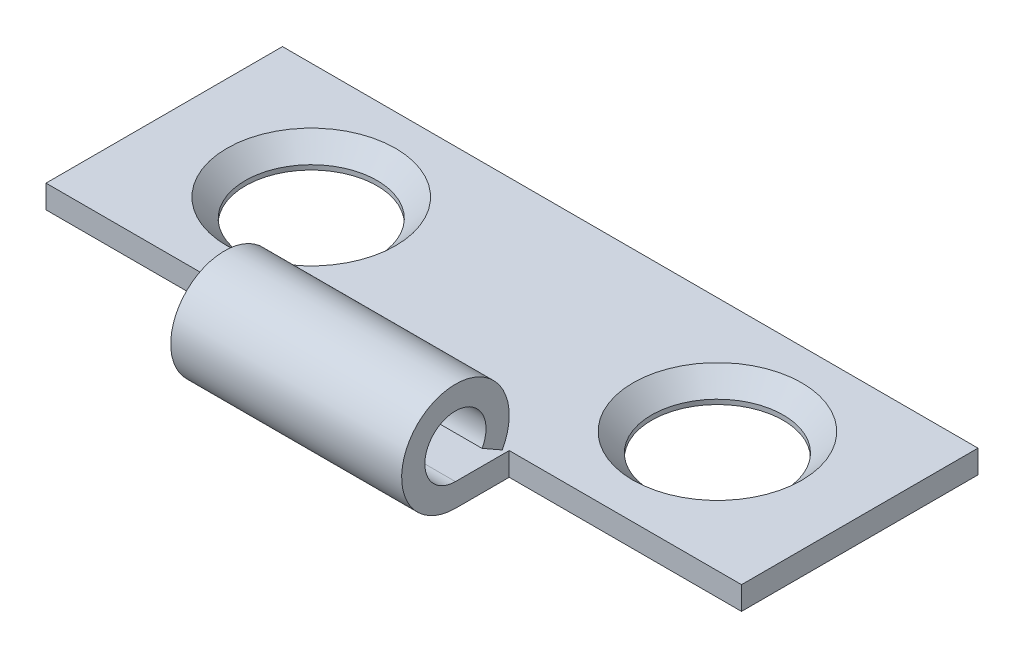
ISO-10303-21;
HEADER;
FILE_DESCRIPTION(('STEP AP214'),'2;1');
FILE_NAME('part.step','',(''),(''),'','','');
FILE_SCHEMA(('AUTOMOTIVE_DESIGN { 1 0 10303 214 1 1 1 1 }'));
ENDSEC;
DATA;
#1=APPLICATION_CONTEXT('core data for automotive mechanical design processes');
#2=APPLICATION_PROTOCOL_DEFINITION('international standard','automotive_design',2000,#1);
#3=PRODUCT_CONTEXT('',#1,'mechanical');
#4=PRODUCT('Part','Part','',(#3));
#5=PRODUCT_RELATED_PRODUCT_CATEGORY('part','',(#4));
#6=PRODUCT_DEFINITION_FORMATION('','',#4);
#7=PRODUCT_DEFINITION_CONTEXT('part definition',#1,'design');
#8=PRODUCT_DEFINITION('design','',#6,#7);
#9=PRODUCT_DEFINITION_SHAPE('','',#8);
#10=(LENGTH_UNIT() NAMED_UNIT(*) SI_UNIT(.MILLI.,.METRE.));
#11=(NAMED_UNIT(*) PLANE_ANGLE_UNIT() SI_UNIT($,.RADIAN.));
#12=(NAMED_UNIT(*) SI_UNIT($,.STERADIAN.) SOLID_ANGLE_UNIT());
#13=UNCERTAINTY_MEASURE_WITH_UNIT(LENGTH_MEASURE(1.E-05),#10,'distance_accuracy_value','');
#14=(GEOMETRIC_REPRESENTATION_CONTEXT(3) GLOBAL_UNCERTAINTY_ASSIGNED_CONTEXT((#13)) GLOBAL_UNIT_ASSIGNED_CONTEXT((#10,
#11,#12)) REPRESENTATION_CONTEXT('',''));
#15=CARTESIAN_POINT('',(0.,0.,0.));
#16=DIRECTION('',(0.,0.,1.));
#17=DIRECTION('',(1.,0.,0.));
#18=AXIS2_PLACEMENT_3D('',#15,#16,#17);
#19=CARTESIAN_POINT('',(-9.525,0.,0.));
#20=DIRECTION('',(1.,0.,0.));
#21=DIRECTION('',(0.,0.,-1.));
#22=AXIS2_PLACEMENT_3D('',#19,#20,#21);
#23=CYLINDRICAL_SURFACE('',#22,1.47320000000008);
#24=DIRECTION('',(1.,0.,0.));
#25=VECTOR('',#24,1.);
#26=CARTESIAN_POINT('',(-9.525,-0.728533124002552,-1.28045215733782));
#27=LINE('',#26,#25);
#28=CARTESIAN_POINT('',(-3.1623,-0.728533124002552,-1.28045215733782));
#29=VERTEX_POINT('',#28);
#30=CARTESIAN_POINT('',(3.16230000000002,-0.728533124002552,-1.28045215733782));
#31=VERTEX_POINT('',#30);
#32=EDGE_CURVE('E185',#29,#31,#27,.T.);
#33=ORIENTED_EDGE('',*,*,#32,.F.);
#34=CARTESIAN_POINT('',(-3.1623,0.,0.));
#35=DIRECTION('',(1.,0.,0.));
#36=DIRECTION('',(0.,0.,-1.));
#37=AXIS2_PLACEMENT_3D('',#34,#35,#36);
#38=CIRCLE('',#37,1.47320000000008);
#39=CARTESIAN_POINT('',(-3.1623,-1.4732,0.));
#40=VERTEX_POINT('',#39);
#41=EDGE_CURVE('E164',#29,#40,#38,.T.);
#42=ORIENTED_EDGE('',*,*,#41,.T.);
#43=DIRECTION('',(1.,0.,0.));
#44=VECTOR('',#43,1.);
#45=CARTESIAN_POINT('',(-9.525,-1.4732,0.));
#46=LINE('',#45,#44);
#47=CARTESIAN_POINT('',(3.16230000000001,-1.4732,0.));
#48=VERTEX_POINT('',#47);
#49=EDGE_CURVE('E135',#40,#48,#46,.T.);
#50=ORIENTED_EDGE('',*,*,#49,.T.);
#51=CARTESIAN_POINT('',(3.16230000000002,0.,0.));
#52=DIRECTION('',(-1.,0.,0.));
#53=DIRECTION('',(0.,0.,1.));
#54=AXIS2_PLACEMENT_3D('',#51,#52,#53);
#55=CIRCLE('',#54,1.47320000000008);
#56=EDGE_CURVE('E156',#48,#31,#55,.T.);
#57=ORIENTED_EDGE('',*,*,#56,.T.);
#58=EDGE_LOOP('',(#33,#42,#50,#57));
#59=FACE_BOUND('',#58,.T.);
#60=ADVANCED_FACE('F36',(#59),#23,.T.);
#61=CARTESIAN_POINT('',(-9.525,0.,0.));
#62=DIRECTION('',(1.,0.,0.));
#63=DIRECTION('',(0.,0.,-1.));
#64=AXIS2_PLACEMENT_3D('',#61,#62,#63);
#65=CYLINDRICAL_SURFACE('',#64,0.8382);
#66=DIRECTION('',(1.,0.,0.));
#67=VECTOR('',#66,1.);
#68=CARTESIAN_POINT('',(-9.525,-0.8382,0.));
#69=LINE('',#68,#67);
#70=CARTESIAN_POINT('',(-3.1623,-0.8382,0.));
#71=VERTEX_POINT('',#70);
#72=CARTESIAN_POINT('',(3.16230000000002,-0.8382,0.));
#73=VERTEX_POINT('',#72);
#74=EDGE_CURVE('E195',#71,#73,#69,.T.);
#75=ORIENTED_EDGE('',*,*,#74,.F.);
#76=CARTESIAN_POINT('',(-3.1623,0.,0.));
#77=DIRECTION('',(1.,0.,0.));
#78=DIRECTION('',(0.,0.,-1.));
#79=AXIS2_PLACEMENT_3D('',#76,#77,#78);
#80=CIRCLE('',#79,0.8382);
#81=CARTESIAN_POINT('',(-3.1623,-0.41451022572559,-0.728533124002553));
#82=VERTEX_POINT('',#81);
#83=EDGE_CURVE('E163',#71,#82,#80,.F.);
#84=ORIENTED_EDGE('',*,*,#83,.T.);
#85=DIRECTION('',(1.,0.,0.));
#86=VECTOR('',#85,1.);
#87=CARTESIAN_POINT('',(-9.525,-0.41451022572559,-0.728533124002553));
#88=LINE('',#87,#86);
#89=CARTESIAN_POINT('',(3.16230000000002,-0.41451022572559,-0.728533124002553));
#90=VERTEX_POINT('',#89);
#91=EDGE_CURVE('E177',#82,#90,#88,.T.);
#92=ORIENTED_EDGE('',*,*,#91,.T.);
#93=CARTESIAN_POINT('',(3.16230000000002,0.,0.));
#94=DIRECTION('',(-1.,0.,0.));
#95=DIRECTION('',(0.,0.,1.));
#96=AXIS2_PLACEMENT_3D('',#93,#94,#95);
#97=CIRCLE('',#96,0.8382);
#98=EDGE_CURVE('E155',#90,#73,#97,.F.);
#99=ORIENTED_EDGE('',*,*,#98,.T.);
#100=EDGE_LOOP('',(#75,#84,#92,#99));
#101=FACE_BOUND('',#100,.T.);
#102=ADVANCED_FACE('F38',(#101),#65,.F.);
#103=CARTESIAN_POINT('',(-9.525,-0.838199999999995,-7.9502));
#104=DIRECTION('',(0.,-1.,0.));
#105=DIRECTION('',(0.,0.,1.));
#106=AXIS2_PLACEMENT_3D('',#103,#104,#105);
#107=PLANE('',#106);
#108=CARTESIAN_POINT('',(5.5626,-0.838199999999997,-4.7752));
#109=DIRECTION('',(0.,1.,0.));
#110=DIRECTION('',(0.,0.,1.));
#111=AXIS2_PLACEMENT_3D('',#108,#109,#110);
#112=CIRCLE('',#111,2.3114);
#113=CARTESIAN_POINT('',(5.5626,-0.838199999999998,-2.4638));
#114=VERTEX_POINT('',#113);
#115=EDGE_CURVE('E149',#114,#114,#112,.T.);
#116=ORIENTED_EDGE('',*,*,#115,.F.);
#117=EDGE_LOOP('',(#116));
#118=FACE_BOUND('',#117,.T.);
#119=CARTESIAN_POINT('',(-5.5626,-0.838199999999997,-4.7752));
#120=DIRECTION('',(0.,1.,0.));
#121=DIRECTION('',(0.,0.,1.));
#122=AXIS2_PLACEMENT_3D('',#119,#120,#121);
#123=CIRCLE('',#122,2.3114);
#124=CARTESIAN_POINT('',(-5.5626,-0.838199999999998,-2.4638));
#125=VERTEX_POINT('',#124);
#126=EDGE_CURVE('E142',#125,#125,#123,.T.);
#127=ORIENTED_EDGE('',*,*,#126,.F.);
#128=EDGE_LOOP('',(#127));
#129=FACE_BOUND('',#128,.T.);
#130=DIRECTION('',(1.,0.,0.));
#131=VECTOR('',#130,1.);
#132=CARTESIAN_POINT('',(-9.525,-0.838199999999999,-1.47320000000003));
#133=LINE('',#132,#131);
#134=CARTESIAN_POINT('',(-9.525,-0.838199999999999,-1.47320000000003));
#135=VERTEX_POINT('',#134);
#136=CARTESIAN_POINT('',(-3.1623,-0.838199999999999,-1.47320000000003));
#137=VERTEX_POINT('',#136);
#138=EDGE_CURVE('E53',#135,#137,#133,.T.);
#139=ORIENTED_EDGE('',*,*,#138,.T.);
#140=DIRECTION('',(0.,0.,1.));
#141=VECTOR('',#140,1.);
#142=CARTESIAN_POINT('',(-3.1623,-0.838199999999995,-7.9502));
#143=LINE('',#142,#141);
#144=EDGE_CURVE('E122',#137,#71,#143,.T.);
#145=ORIENTED_EDGE('',*,*,#144,.T.);
#146=ORIENTED_EDGE('',*,*,#74,.T.);
#147=DIRECTION('',(0.,0.,-1.));
#148=VECTOR('',#147,1.);
#149=CARTESIAN_POINT('',(3.16230000000002,-0.838199999999995,-7.9502));
#150=LINE('',#149,#148);
#151=CARTESIAN_POINT('',(3.16230000000001,-0.838199999999999,-1.47320000000003));
#152=VERTEX_POINT('',#151);
#153=EDGE_CURVE('E158',#73,#152,#150,.T.);
#154=ORIENTED_EDGE('',*,*,#153,.T.);
#155=DIRECTION('',(1.,0.,0.));
#156=VECTOR('',#155,1.);
#157=CARTESIAN_POINT('',(-9.525,-0.838199999999999,-1.47320000000003));
#158=LINE('',#157,#156);
#159=CARTESIAN_POINT('',(9.525,-0.838199999999998,-1.47320000000003));
#160=VERTEX_POINT('',#159);
#161=EDGE_CURVE('E145',#152,#160,#158,.T.);
#162=ORIENTED_EDGE('',*,*,#161,.T.);
#163=DIRECTION('',(0.,0.,-1.));
#164=VECTOR('',#163,1.);
#165=CARTESIAN_POINT('',(9.525,-0.838199999999995,-7.9502));
#166=LINE('',#165,#164);
#167=CARTESIAN_POINT('',(9.525,-0.838199999999995,-7.9502));
#168=VERTEX_POINT('',#167);
#169=EDGE_CURVE('E169',#160,#168,#166,.T.);
#170=ORIENTED_EDGE('',*,*,#169,.T.);
#171=DIRECTION('',(1.,0.,0.));
#172=VECTOR('',#171,1.);
#173=CARTESIAN_POINT('',(-9.525,-0.838199999999995,-7.9502));
#174=LINE('',#173,#172);
#175=CARTESIAN_POINT('',(-9.525,-0.838199999999995,-7.9502));
#176=VERTEX_POINT('',#175);
#177=EDGE_CURVE('E192',#176,#168,#174,.T.);
#178=ORIENTED_EDGE('',*,*,#177,.F.);
#179=DIRECTION('',(0.,0.,-1.));
#180=VECTOR('',#179,1.);
#181=CARTESIAN_POINT('',(-9.525,-0.838199999999995,-7.9502));
#182=LINE('',#181,#180);
#183=EDGE_CURVE('E170',#135,#176,#182,.T.);
#184=ORIENTED_EDGE('',*,*,#183,.F.);
#185=EDGE_LOOP('',(#139,#145,#146,#154,#162,#170,#178,#184));
#186=FACE_BOUND('',#185,.T.);
#187=ADVANCED_FACE('F220',(#118,#129,#186),#107,.F.);
#188=CARTESIAN_POINT('',(-9.525,-1.4732,-7.9502));
#189=DIRECTION('',(0.,0.,1.));
#190=DIRECTION('',(1.,0.,0.));
#191=AXIS2_PLACEMENT_3D('',#188,#189,#190);
#192=PLANE('',#191);
#193=DIRECTION('',(0.,-1.,0.));
#194=VECTOR('',#193,1.);
#195=CARTESIAN_POINT('',(9.525,-1.4732,-7.9502));
#196=LINE('',#195,#194);
#197=CARTESIAN_POINT('',(9.525,-1.4732,-7.9502));
#198=VERTEX_POINT('',#197);
#199=EDGE_CURVE('E179',#168,#198,#196,.T.);
#200=ORIENTED_EDGE('',*,*,#199,.T.);
#201=DIRECTION('',(1.,0.,0.));
#202=VECTOR('',#201,1.);
#203=CARTESIAN_POINT('',(-9.525,-1.4732,-7.9502));
#204=LINE('',#203,#202);
#205=CARTESIAN_POINT('',(-9.525,-1.4732,-7.9502));
#206=VERTEX_POINT('',#205);
#207=EDGE_CURVE('E189',#206,#198,#204,.T.);
#208=ORIENTED_EDGE('',*,*,#207,.F.);
#209=DIRECTION('',(0.,-1.,0.));
#210=VECTOR('',#209,1.);
#211=CARTESIAN_POINT('',(-9.525,-1.4732,-7.9502));
#212=LINE('',#211,#210);
#213=EDGE_CURVE('E172',#176,#206,#212,.T.);
#214=ORIENTED_EDGE('',*,*,#213,.F.);
#215=ORIENTED_EDGE('',*,*,#177,.T.);
#216=EDGE_LOOP('',(#200,#208,#214,#215));
#217=FACE_BOUND('',#216,.T.);
#218=ADVANCED_FACE('F223',(#217),#192,.F.);
#219=CARTESIAN_POINT('',(-9.525,-1.4732,0.));
#220=DIRECTION('',(0.,1.,0.));
#221=DIRECTION('',(0.,0.,-1.));
#222=AXIS2_PLACEMENT_3D('',#219,#220,#221);
#223=PLANE('',#222);
#224=CARTESIAN_POINT('',(-5.5626,-1.47320000000001,-4.7752));
#225=DIRECTION('',(0.,1.,0.));
#226=DIRECTION('',(0.,0.,1.));
#227=AXIS2_PLACEMENT_3D('',#224,#225,#226);
#228=CIRCLE('',#227,1.8034);
#229=CARTESIAN_POINT('',(-5.5626,-1.47320000000001,-2.9718));
#230=VERTEX_POINT('',#229);
#231=EDGE_CURVE('E201',#230,#230,#228,.T.);
#232=ORIENTED_EDGE('',*,*,#231,.T.);
#233=EDGE_LOOP('',(#232));
#234=FACE_BOUND('',#233,.T.);
#235=CARTESIAN_POINT('',(5.5626,-1.47320000000001,-4.7752));
#236=DIRECTION('',(0.,1.,0.));
#237=DIRECTION('',(0.,0.,1.));
#238=AXIS2_PLACEMENT_3D('',#235,#236,#237);
#239=CIRCLE('',#238,1.8034);
#240=CARTESIAN_POINT('',(5.5626,-1.47320000000001,-2.9718));
#241=VERTEX_POINT('',#240);
#242=EDGE_CURVE('E206',#241,#241,#239,.T.);
#243=ORIENTED_EDGE('',*,*,#242,.T.);
#244=EDGE_LOOP('',(#243));
#245=FACE_BOUND('',#244,.T.);
#246=ORIENTED_EDGE('',*,*,#49,.F.);
#247=DIRECTION('',(0.,0.,-1.));
#248=VECTOR('',#247,1.);
#249=CARTESIAN_POINT('',(-3.1623,-1.4732,-1.47320000000003));
#250=LINE('',#249,#248);
#251=CARTESIAN_POINT('',(-3.1623,-1.4732,-1.47320000000003));
#252=VERTEX_POINT('',#251);
#253=EDGE_CURVE('E119',#40,#252,#250,.T.);
#254=ORIENTED_EDGE('',*,*,#253,.T.);
#255=DIRECTION('',(-1.,0.,0.));
#256=VECTOR('',#255,1.);
#257=CARTESIAN_POINT('',(-3.1623,-1.4732,-1.47320000000003));
#258=LINE('',#257,#256);
#259=CARTESIAN_POINT('',(-9.52499999999999,-1.4732,-1.47320000000003));
#260=VERTEX_POINT('',#259);
#261=EDGE_CURVE('E124',#252,#260,#258,.T.);
#262=ORIENTED_EDGE('',*,*,#261,.T.);
#263=DIRECTION('',(0.,0.,1.));
#264=VECTOR('',#263,1.);
#265=CARTESIAN_POINT('',(-9.525,-1.4732,0.));
#266=LINE('',#265,#264);
#267=EDGE_CURVE('E175',#206,#260,#266,.T.);
#268=ORIENTED_EDGE('',*,*,#267,.F.);
#269=ORIENTED_EDGE('',*,*,#207,.T.);
#270=DIRECTION('',(0.,0.,1.));
#271=VECTOR('',#270,1.);
#272=CARTESIAN_POINT('',(9.525,-1.4732,0.));
#273=LINE('',#272,#271);
#274=CARTESIAN_POINT('',(9.525,-1.4732,-1.47320000000003));
#275=VERTEX_POINT('',#274);
#276=EDGE_CURVE('E173',#198,#275,#273,.T.);
#277=ORIENTED_EDGE('',*,*,#276,.T.);
#278=DIRECTION('',(-1.,0.,0.));
#279=VECTOR('',#278,1.);
#280=CARTESIAN_POINT('',(3.16230000000001,-1.4732,-1.47320000000003));
#281=LINE('',#280,#279);
#282=CARTESIAN_POINT('',(3.16230000000001,-1.4732,-1.47320000000003));
#283=VERTEX_POINT('',#282);
#284=EDGE_CURVE('E61',#275,#283,#281,.T.);
#285=ORIENTED_EDGE('',*,*,#284,.T.);
#286=DIRECTION('',(0.,0.,1.));
#287=VECTOR('',#286,1.);
#288=CARTESIAN_POINT('',(3.16230000000001,-1.4732,-1.47320000000003));
#289=LINE('',#288,#287);
#290=EDGE_CURVE('E147',#283,#48,#289,.T.);
#291=ORIENTED_EDGE('',*,*,#290,.T.);
#292=EDGE_LOOP('',(#246,#254,#262,#268,#269,#277,#285,#291));
#293=FACE_BOUND('',#292,.T.);
#294=ADVANCED_FACE('F132',(#234,#245,#293),#223,.F.);
#295=CARTESIAN_POINT('',(-9.525,-0.41451022572559,-0.728533124002553));
#296=DIRECTION('',(0.,0.869163832024043,-0.49452424925506));
#297=DIRECTION('',(0.,-0.49452424925506,-0.869163832024044));
#298=AXIS2_PLACEMENT_3D('',#295,#296,#297);
#299=PLANE('',#298);
#300=ORIENTED_EDGE('',*,*,#91,.F.);
#301=DIRECTION('',(0.,-0.49452424925506,-0.869163832024044));
#302=VECTOR('',#301,1.);
#303=CARTESIAN_POINT('',(-3.1623,-0.414510225725591,-0.728533124002554));
#304=LINE('',#303,#302);
#305=EDGE_CURVE('E11',#82,#29,#304,.T.);
#306=ORIENTED_EDGE('',*,*,#305,.T.);
#307=ORIENTED_EDGE('',*,*,#32,.T.);
#308=DIRECTION('',(0.,0.49452424925506,0.869163832024044));
#309=VECTOR('',#308,1.);
#310=CARTESIAN_POINT('',(3.16230000000002,-0.41451022572559,-0.728533124002553));
#311=LINE('',#310,#309);
#312=EDGE_CURVE('E45',#31,#90,#311,.T.);
#313=ORIENTED_EDGE('',*,*,#312,.T.);
#314=EDGE_LOOP('',(#300,#306,#307,#313));
#315=FACE_BOUND('',#314,.T.);
#316=ADVANCED_FACE('F246',(#315),#299,.F.);
#317=CARTESIAN_POINT('',(-9.525,0.,0.));
#318=DIRECTION('',(1.,0.,0.));
#319=DIRECTION('',(0.,0.,-1.));
#320=AXIS2_PLACEMENT_3D('',#317,#318,#319);
#321=PLANE('',#320);
#322=ORIENTED_EDGE('',*,*,#267,.T.);
#323=DIRECTION('',(0.,1.,0.));
#324=VECTOR('',#323,1.);
#325=CARTESIAN_POINT('',(-9.52499999999999,-1.4732,-1.47320000000003));
#326=LINE('',#325,#324);
#327=EDGE_CURVE('E123',#260,#135,#326,.T.);
#328=ORIENTED_EDGE('',*,*,#327,.T.);
#329=ORIENTED_EDGE('',*,*,#183,.T.);
#330=ORIENTED_EDGE('',*,*,#213,.T.);
#331=EDGE_LOOP('',(#322,#328,#329,#330));
#332=FACE_BOUND('',#331,.T.);
#333=ADVANCED_FACE('F230',(#332),#321,.F.);
#334=CARTESIAN_POINT('',(9.525,0.,0.));
#335=DIRECTION('',(1.,0.,0.));
#336=DIRECTION('',(0.,0.,-1.));
#337=AXIS2_PLACEMENT_3D('',#334,#335,#336);
#338=PLANE('',#337);
#339=DIRECTION('',(0.,1.,0.));
#340=VECTOR('',#339,1.);
#341=CARTESIAN_POINT('',(9.525,-1.4732,-1.47320000000003));
#342=LINE('',#341,#340);
#343=EDGE_CURVE('E139',#275,#160,#342,.T.);
#344=ORIENTED_EDGE('',*,*,#343,.F.);
#345=ORIENTED_EDGE('',*,*,#276,.F.);
#346=ORIENTED_EDGE('',*,*,#199,.F.);
#347=ORIENTED_EDGE('',*,*,#169,.F.);
#348=EDGE_LOOP('',(#344,#345,#346,#347));
#349=FACE_BOUND('',#348,.T.);
#350=ADVANCED_FACE('F236',(#349),#338,.T.);
#351=CARTESIAN_POINT('',(3.16230000000001,-1.4732,-1.47320000000003));
#352=DIRECTION('',(-1.,0.,0.));
#353=DIRECTION('',(0.,0.,1.));
#354=AXIS2_PLACEMENT_3D('',#351,#352,#353);
#355=PLANE('',#354);
#356=ORIENTED_EDGE('',*,*,#98,.F.);
#357=ORIENTED_EDGE('',*,*,#312,.F.);
#358=ORIENTED_EDGE('',*,*,#56,.F.);
#359=ORIENTED_EDGE('',*,*,#290,.F.);
#360=DIRECTION('',(0.,1.,0.));
#361=VECTOR('',#360,1.);
#362=CARTESIAN_POINT('',(3.16230000000001,-1.4732,-1.47320000000003));
#363=LINE('',#362,#361);
#364=EDGE_CURVE('E136',#283,#152,#363,.T.);
#365=ORIENTED_EDGE('',*,*,#364,.T.);
#366=ORIENTED_EDGE('',*,*,#153,.F.);
#367=EDGE_LOOP('',(#356,#357,#358,#359,#365,#366));
#368=FACE_BOUND('',#367,.T.);
#369=ADVANCED_FACE('F240',(#368),#355,.F.);
#370=CARTESIAN_POINT('',(3.16230000000001,-1.4732,-1.47320000000003));
#371=DIRECTION('',(0.,0.,-1.));
#372=DIRECTION('',(-1.,0.,0.));
#373=AXIS2_PLACEMENT_3D('',#370,#371,#372);
#374=PLANE('',#373);
#375=ORIENTED_EDGE('',*,*,#364,.F.);
#376=ORIENTED_EDGE('',*,*,#284,.F.);
#377=ORIENTED_EDGE('',*,*,#343,.T.);
#378=ORIENTED_EDGE('',*,*,#161,.F.);
#379=EDGE_LOOP('',(#375,#376,#377,#378));
#380=FACE_BOUND('',#379,.T.);
#381=ADVANCED_FACE('F238',(#380),#374,.F.);
#382=CARTESIAN_POINT('',(-3.1623,-1.4732,-1.47320000000003));
#383=DIRECTION('',(1.,0.,0.));
#384=DIRECTION('',(0.,0.,-1.));
#385=AXIS2_PLACEMENT_3D('',#382,#383,#384);
#386=PLANE('',#385);
#387=ORIENTED_EDGE('',*,*,#41,.F.);
#388=ORIENTED_EDGE('',*,*,#305,.F.);
#389=ORIENTED_EDGE('',*,*,#83,.F.);
#390=ORIENTED_EDGE('',*,*,#144,.F.);
#391=DIRECTION('',(0.,1.,0.));
#392=VECTOR('',#391,1.);
#393=CARTESIAN_POINT('',(-3.1623,-1.4732,-1.47320000000003));
#394=LINE('',#393,#392);
#395=EDGE_CURVE('E115',#252,#137,#394,.T.);
#396=ORIENTED_EDGE('',*,*,#395,.F.);
#397=ORIENTED_EDGE('',*,*,#253,.F.);
#398=EDGE_LOOP('',(#387,#388,#389,#390,#396,#397));
#399=FACE_BOUND('',#398,.T.);
#400=ADVANCED_FACE('F117',(#399),#386,.F.);
#401=CARTESIAN_POINT('',(-3.1623,-1.4732,-1.47320000000003));
#402=DIRECTION('',(0.,0.,-1.));
#403=DIRECTION('',(-1.,0.,0.));
#404=AXIS2_PLACEMENT_3D('',#401,#402,#403);
#405=PLANE('',#404);
#406=ORIENTED_EDGE('',*,*,#327,.F.);
#407=ORIENTED_EDGE('',*,*,#261,.F.);
#408=ORIENTED_EDGE('',*,*,#395,.T.);
#409=ORIENTED_EDGE('',*,*,#138,.F.);
#410=EDGE_LOOP('',(#406,#407,#408,#409));
#411=FACE_BOUND('',#410,.T.);
#412=ADVANCED_FACE('F127',(#411),#405,.F.);
#413=CARTESIAN_POINT('',(-5.5626,-0.838199999999997,-4.7752));
#414=DIRECTION('',(0.,1.,0.));
#415=DIRECTION('',(0.,0.,1.));
#416=AXIS2_PLACEMENT_3D('',#413,#414,#415);
#417=CONICAL_SURFACE('',#416,2.3114,0.78539816339745);
#418=CARTESIAN_POINT('',(-5.5626,-1.3462,-4.7752));
#419=DIRECTION('',(0.,1.,0.));
#420=DIRECTION('',(0.,0.,1.));
#421=AXIS2_PLACEMENT_3D('',#418,#419,#420);
#422=CIRCLE('',#421,1.8034);
#423=CARTESIAN_POINT('',(-5.5626,-1.3462,-2.9718));
#424=VERTEX_POINT('',#423);
#425=EDGE_CURVE('E40',#424,#424,#422,.F.);
#426=ORIENTED_EDGE('',*,*,#425,.T.);
#427=EDGE_LOOP('',(#426));
#428=FACE_BOUND('',#427,.T.);
#429=ORIENTED_EDGE('',*,*,#126,.T.);
#430=EDGE_LOOP('',(#429));
#431=FACE_BOUND('',#430,.T.);
#432=ADVANCED_FACE('F218',(#428,#431),#417,.F.);
#433=CARTESIAN_POINT('',(5.5626,-0.838199999999997,-4.7752));
#434=DIRECTION('',(0.,1.,0.));
#435=DIRECTION('',(0.,0.,1.));
#436=AXIS2_PLACEMENT_3D('',#433,#434,#435);
#437=CONICAL_SURFACE('',#436,2.3114,0.78539816339745);
#438=CARTESIAN_POINT('',(5.5626,-1.3462,-4.7752));
#439=DIRECTION('',(0.,1.,0.));
#440=DIRECTION('',(0.,0.,1.));
#441=AXIS2_PLACEMENT_3D('',#438,#439,#440);
#442=CIRCLE('',#441,1.8034);
#443=CARTESIAN_POINT('',(5.5626,-1.3462,-2.9718));
#444=VERTEX_POINT('',#443);
#445=EDGE_CURVE('E199',#444,#444,#442,.F.);
#446=ORIENTED_EDGE('',*,*,#445,.T.);
#447=EDGE_LOOP('',(#446));
#448=FACE_BOUND('',#447,.T.);
#449=ORIENTED_EDGE('',*,*,#115,.T.);
#450=EDGE_LOOP('',(#449));
#451=FACE_BOUND('',#450,.T.);
#452=ADVANCED_FACE('F323',(#448,#451),#437,.F.);
#453=CARTESIAN_POINT('',(5.5626,-1.47320000000001,-4.7752));
#454=DIRECTION('',(0.,1.,0.));
#455=DIRECTION('',(0.,0.,1.));
#456=AXIS2_PLACEMENT_3D('',#453,#454,#455);
#457=CYLINDRICAL_SURFACE('',#456,1.8034);
#458=ORIENTED_EDGE('',*,*,#242,.F.);
#459=EDGE_LOOP('',(#458));
#460=FACE_BOUND('',#459,.T.);
#461=ORIENTED_EDGE('',*,*,#445,.F.);
#462=EDGE_LOOP('',(#461));
#463=FACE_BOUND('',#462,.T.);
#464=ADVANCED_FACE('F332',(#460,#463),#457,.F.);
#465=CARTESIAN_POINT('',(-5.5626,-1.47320000000001,-4.7752));
#466=DIRECTION('',(0.,1.,0.));
#467=DIRECTION('',(0.,0.,1.));
#468=AXIS2_PLACEMENT_3D('',#465,#466,#467);
#469=CYLINDRICAL_SURFACE('',#468,1.8034);
#470=ORIENTED_EDGE('',*,*,#231,.F.);
#471=EDGE_LOOP('',(#470));
#472=FACE_BOUND('',#471,.T.);
#473=ORIENTED_EDGE('',*,*,#425,.F.);
#474=EDGE_LOOP('',(#473));
#475=FACE_BOUND('',#474,.T.);
#476=ADVANCED_FACE('F340',(#472,#475),#469,.F.);
#477=CLOSED_SHELL('',(#60,#102,#187,#218,#294,#316,#333,#350,#369,#381,#400,#412,#432,#452,#464,#476));
#478=MANIFOLD_SOLID_BREP('B2',#477);
#479=ADVANCED_BREP_SHAPE_REPRESENTATION('',(#18,#478),#14);
#480=SHAPE_DEFINITION_REPRESENTATION(#9,#479);
ENDSEC;
END-ISO-10303-21;
